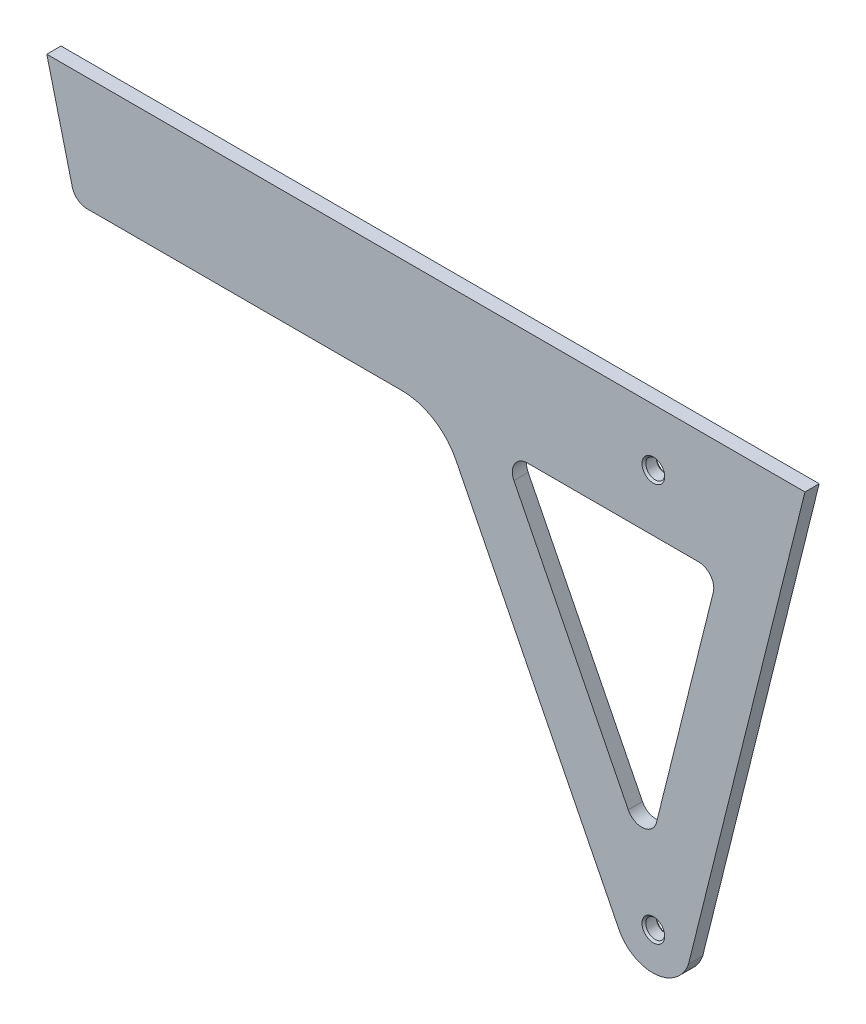
ISO-10303-21;
HEADER;
FILE_DESCRIPTION(('STEP AP214'),'2;1');
FILE_NAME('part.step','',(''),(''),'','','');
FILE_SCHEMA(('AUTOMOTIVE_DESIGN { 1 0 10303 214 1 1 1 1 }'));
ENDSEC;
DATA;
#1=APPLICATION_CONTEXT('core data for automotive mechanical design processes');
#2=APPLICATION_PROTOCOL_DEFINITION('international standard','automotive_design',2000,#1);
#3=PRODUCT_CONTEXT('',#1,'mechanical');
#4=PRODUCT('Part','Part','',(#3));
#5=PRODUCT_RELATED_PRODUCT_CATEGORY('part','',(#4));
#6=PRODUCT_DEFINITION_FORMATION('','',#4);
#7=PRODUCT_DEFINITION_CONTEXT('part definition',#1,'design');
#8=PRODUCT_DEFINITION('design','',#6,#7);
#9=PRODUCT_DEFINITION_SHAPE('','',#8);
#10=(LENGTH_UNIT() NAMED_UNIT(*) SI_UNIT(.MILLI.,.METRE.));
#11=(NAMED_UNIT(*) PLANE_ANGLE_UNIT() SI_UNIT($,.RADIAN.));
#12=(NAMED_UNIT(*) SI_UNIT($,.STERADIAN.) SOLID_ANGLE_UNIT());
#13=UNCERTAINTY_MEASURE_WITH_UNIT(LENGTH_MEASURE(1.E-05),#10,'distance_accuracy_value','');
#14=(GEOMETRIC_REPRESENTATION_CONTEXT(3) GLOBAL_UNCERTAINTY_ASSIGNED_CONTEXT((#13)) GLOBAL_UNIT_ASSIGNED_CONTEXT((#10,
#11,#12)) REPRESENTATION_CONTEXT('',''));
#15=CARTESIAN_POINT('',(0.,0.,0.));
#16=DIRECTION('',(0.,0.,1.));
#17=DIRECTION('',(1.,0.,0.));
#18=AXIS2_PLACEMENT_3D('',#15,#16,#17);
#19=CARTESIAN_POINT('',(118.956511571512,-58.4199804180646,4.7625));
#20=DIRECTION('',(0.,0.,1.));
#21=DIRECTION('',(1.,0.,0.));
#22=AXIS2_PLACEMENT_3D('',#19,#20,#21);
#23=PLANE('',#22);
#24=CARTESIAN_POINT('',(203.2,-19.05,4.7625));
#25=DIRECTION('',(0.,0.,1.));
#26=DIRECTION('',(1.,0.,0.));
#27=AXIS2_PLACEMENT_3D('',#24,#25,#26);
#28=CIRCLE('',#27,3.81000000000012);
#29=CARTESIAN_POINT('',(207.01,-19.05,4.7625));
#30=VERTEX_POINT('',#29);
#31=EDGE_CURVE('E257',#30,#30,#28,.F.);
#32=ORIENTED_EDGE('',*,*,#31,.T.);
#33=EDGE_LOOP('',(#32));
#34=FACE_BOUND('',#33,.T.);
#35=CARTESIAN_POINT('',(203.2,-152.4,4.7625));
#36=DIRECTION('',(0.,0.,1.));
#37=DIRECTION('',(1.,0.,0.));
#38=AXIS2_PLACEMENT_3D('',#35,#36,#37);
#39=CIRCLE('',#38,3.81000000000012);
#40=CARTESIAN_POINT('',(207.01,-152.4,4.7625));
#41=VERTEX_POINT('',#40);
#42=EDGE_CURVE('E251',#41,#41,#39,.F.);
#43=ORIENTED_EDGE('',*,*,#42,.T.);
#44=EDGE_LOOP('',(#43));
#45=FACE_BOUND('',#44,.T.);
#46=CARTESIAN_POINT('',(118.956511571512,-58.4199804180646,4.7625));
#47=DIRECTION('',(0.,0.,1.));
#48=DIRECTION('',(1.,0.,0.));
#49=AXIS2_PLACEMENT_3D('',#46,#47,#48);
#50=CIRCLE('',#49,20.32);
#51=CARTESIAN_POINT('',(137.120577334866,-49.3112420342629,4.7625));
#52=VERTEX_POINT('',#51);
#53=CARTESIAN_POINT('',(118.984721666729,-38.1,4.7625));
#54=VERTEX_POINT('',#53);
#55=EDGE_CURVE('E190',#52,#54,#50,.T.);
#56=ORIENTED_EDGE('',*,*,#55,.F.);
#57=DIRECTION('',(0.448264684242211,-0.893900874180818,0.));
#58=VECTOR('',#57,1.);
#59=CARTESIAN_POINT('',(137.120577334866,-49.3112420342629,4.7625));
#60=LINE('',#59,#58);
#61=CARTESIAN_POINT('',(191.635932138626,-158.022289387322,4.7625));
#62=VERTEX_POINT('',#61);
#63=EDGE_CURVE('E208',#52,#62,#60,.T.);
#64=ORIENTED_EDGE('',*,*,#63,.T.);
#65=CARTESIAN_POINT('',(202.988473240723,-152.329327897446,4.7625));
#66=DIRECTION('',(0.,0.,1.));
#67=DIRECTION('',(1.,0.,0.));
#68=AXIS2_PLACEMENT_3D('',#65,#66,#67);
#69=CIRCLE('',#68,12.7);
#70=CARTESIAN_POINT('',(214.970337379944,-156.539426678856,4.7625));
#71=VERTEX_POINT('',#70);
#72=EDGE_CURVE('E206',#62,#71,#69,.T.);
#73=ORIENTED_EDGE('',*,*,#72,.T.);
#74=DIRECTION('',(-0.241921895599668,-0.970295726275996,0.));
#75=VECTOR('',#74,1.);
#76=CARTESIAN_POINT('',(254.,0.,4.7625));
#77=LINE('',#76,#75);
#78=CARTESIAN_POINT('',(254.,0.,4.7625));
#79=VERTEX_POINT('',#78);
#80=EDGE_CURVE('E203',#79,#71,#77,.T.);
#81=ORIENTED_EDGE('',*,*,#80,.F.);
#82=DIRECTION('',(1.,0.,0.));
#83=VECTOR('',#82,1.);
#84=CARTESIAN_POINT('',(0.,0.,4.7625));
#85=LINE('',#84,#83);
#86=CARTESIAN_POINT('',(0.,0.,4.7625));
#87=VERTEX_POINT('',#86);
#88=EDGE_CURVE('E200',#87,#79,#85,.T.);
#89=ORIENTED_EDGE('',*,*,#88,.F.);
#90=DIRECTION('',(0.241921895599669,-0.970295726275996,0.));
#91=VECTOR('',#90,1.);
#92=CARTESIAN_POINT('',(0.,0.,4.7625));
#93=LINE('',#92,#91);
#94=CARTESIAN_POINT('',(8.53922560149728,-34.2489632296463,4.7625));
#95=VERTEX_POINT('',#94);
#96=EDGE_CURVE('E198',#87,#95,#93,.T.);
#97=ORIENTED_EDGE('',*,*,#96,.T.);
#98=CARTESIAN_POINT('',(13.4683278909793,-33.02,4.7625));
#99=DIRECTION('',(0.,0.,1.));
#100=DIRECTION('',(1.,0.,0.));
#101=AXIS2_PLACEMENT_3D('',#98,#99,#100);
#102=CIRCLE('',#101,5.08);
#103=CARTESIAN_POINT('',(13.4683278909794,-38.1,4.7625));
#104=VERTEX_POINT('',#103);
#105=EDGE_CURVE('E196',#95,#104,#102,.T.);
#106=ORIENTED_EDGE('',*,*,#105,.T.);
#107=DIRECTION('',(1.,0.,0.));
#108=VECTOR('',#107,1.);
#109=CARTESIAN_POINT('',(13.4683278909794,-38.1,4.7625));
#110=LINE('',#109,#108);
#111=EDGE_CURVE('E193',#104,#54,#110,.T.);
#112=ORIENTED_EDGE('',*,*,#111,.T.);
#113=EDGE_LOOP('',(#56,#64,#73,#81,#89,#97,#106,#112));
#114=FACE_BOUND('',#113,.T.);
#115=DIRECTION('',(-0.241921895599668,-0.970295726275996,0.));
#116=VECTOR('',#115,1.);
#117=CARTESIAN_POINT('',(223.2944122505,-44.4089632296464,4.7625));
#118=LINE('',#117,#116);
#119=CARTESIAN_POINT('',(223.2944122505,-44.4089632296464,4.7625));
#120=VERTEX_POINT('',#119);
#121=CARTESIAN_POINT('',(204.257595644947,-120.761464306418,4.7625));
#122=VERTEX_POINT('',#121);
#123=EDGE_CURVE('E146',#120,#122,#118,.T.);
#124=ORIENTED_EDGE('',*,*,#123,.T.);
#125=CARTESIAN_POINT('',(199.328493355465,-119.532501076772,4.7625));
#126=DIRECTION('',(0.,0.,-1.));
#127=DIRECTION('',(-1.,0.,0.));
#128=AXIS2_PLACEMENT_3D('',#125,#126,#127);
#129=CIRCLE('',#128,5.08);
#130=CARTESIAN_POINT('',(194.787476914626,-121.809685672722,4.7625));
#131=VERTEX_POINT('',#130);
#132=EDGE_CURVE('E50',#122,#131,#129,.T.);
#133=ORIENTED_EDGE('',*,*,#132,.T.);
#134=DIRECTION('',(-0.44826468424221,0.893900874180818,0.));
#135=VECTOR('',#134,1.);
#136=CARTESIAN_POINT('',(194.787476914626,-121.809685672722,4.7625));
#137=LINE('',#136,#135);
#138=CARTESIAN_POINT('',(156.498970017654,-45.4571845959505,4.7625));
#139=VERTEX_POINT('',#138);
#140=EDGE_CURVE('E152',#131,#139,#137,.T.);
#141=ORIENTED_EDGE('',*,*,#140,.T.);
#142=CARTESIAN_POINT('',(161.039986458493,-43.18,4.7625));
#143=DIRECTION('',(0.,0.,1.));
#144=DIRECTION('',(1.,0.,0.));
#145=AXIS2_PLACEMENT_3D('',#142,#143,#144);
#146=CIRCLE('',#145,5.08);
#147=CARTESIAN_POINT('',(161.039986458493,-38.1,4.7625));
#148=VERTEX_POINT('',#147);
#149=EDGE_CURVE('E171',#148,#139,#146,.T.);
#150=ORIENTED_EDGE('',*,*,#149,.F.);
#151=DIRECTION('',(1.,0.,0.));
#152=VECTOR('',#151,1.);
#153=CARTESIAN_POINT('',(161.039986458493,-38.1,4.7625));
#154=LINE('',#153,#152);
#155=CARTESIAN_POINT('',(218.365309961018,-38.1,4.7625));
#156=VERTEX_POINT('',#155);
#157=EDGE_CURVE('E174',#148,#156,#154,.T.);
#158=ORIENTED_EDGE('',*,*,#157,.T.);
#159=CARTESIAN_POINT('',(218.365309961018,-43.18,4.7625));
#160=DIRECTION('',(0.,0.,1.));
#161=DIRECTION('',(1.,0.,0.));
#162=AXIS2_PLACEMENT_3D('',#159,#160,#161);
#163=CIRCLE('',#162,5.08);
#164=EDGE_CURVE('E177',#120,#156,#163,.T.);
#165=ORIENTED_EDGE('',*,*,#164,.F.);
#166=EDGE_LOOP('',(#124,#133,#141,#150,#158,#165));
#167=FACE_BOUND('',#166,.T.);
#168=ADVANCED_FACE('F34',(#34,#45,#114,#167),#23,.T.);
#169=CARTESIAN_POINT('',(118.956511571512,-58.4199804180646,0.));
#170=DIRECTION('',(0.,0.,1.));
#171=DIRECTION('',(1.,0.,0.));
#172=AXIS2_PLACEMENT_3D('',#169,#170,#171);
#173=PLANE('',#172);
#174=CARTESIAN_POINT('',(203.2,-152.4,0.));
#175=DIRECTION('',(0.,0.,1.));
#176=DIRECTION('',(1.,0.,0.));
#177=AXIS2_PLACEMENT_3D('',#174,#175,#176);
#178=CIRCLE('',#177,3.80999999999976);
#179=CARTESIAN_POINT('',(207.01,-152.4,0.));
#180=VERTEX_POINT('',#179);
#181=EDGE_CURVE('E43',#180,#180,#178,.T.);
#182=ORIENTED_EDGE('',*,*,#181,.T.);
#183=EDGE_LOOP('',(#182));
#184=FACE_BOUND('',#183,.T.);
#185=CARTESIAN_POINT('',(203.2,-19.05,0.));
#186=DIRECTION('',(0.,0.,1.));
#187=DIRECTION('',(1.,0.,0.));
#188=AXIS2_PLACEMENT_3D('',#185,#186,#187);
#189=CIRCLE('',#188,3.80999999999984);
#190=CARTESIAN_POINT('',(207.01,-19.05,0.));
#191=VERTEX_POINT('',#190);
#192=EDGE_CURVE('E260',#191,#191,#189,.T.);
#193=ORIENTED_EDGE('',*,*,#192,.T.);
#194=EDGE_LOOP('',(#193));
#195=FACE_BOUND('',#194,.T.);
#196=CARTESIAN_POINT('',(118.956511571512,-58.4199804180646,0.));
#197=DIRECTION('',(0.,0.,1.));
#198=DIRECTION('',(1.,0.,0.));
#199=AXIS2_PLACEMENT_3D('',#196,#197,#198);
#200=CIRCLE('',#199,20.32);
#201=CARTESIAN_POINT('',(137.120577334866,-49.3112420342629,0.));
#202=VERTEX_POINT('',#201);
#203=CARTESIAN_POINT('',(118.984721666729,-38.1,0.));
#204=VERTEX_POINT('',#203);
#205=EDGE_CURVE('E153',#202,#204,#200,.T.);
#206=ORIENTED_EDGE('',*,*,#205,.T.);
#207=DIRECTION('',(1.,0.,0.));
#208=VECTOR('',#207,1.);
#209=CARTESIAN_POINT('',(13.4683278909794,-38.1,0.));
#210=LINE('',#209,#208);
#211=CARTESIAN_POINT('',(13.4683278909794,-38.1,0.));
#212=VERTEX_POINT('',#211);
#213=EDGE_CURVE('E213',#212,#204,#210,.T.);
#214=ORIENTED_EDGE('',*,*,#213,.F.);
#215=CARTESIAN_POINT('',(13.4683278909793,-33.02,0.));
#216=DIRECTION('',(0.,0.,1.));
#217=DIRECTION('',(1.,0.,0.));
#218=AXIS2_PLACEMENT_3D('',#215,#216,#217);
#219=CIRCLE('',#218,5.08);
#220=CARTESIAN_POINT('',(8.53922560149728,-34.2489632296463,0.));
#221=VERTEX_POINT('',#220);
#222=EDGE_CURVE('E216',#221,#212,#219,.T.);
#223=ORIENTED_EDGE('',*,*,#222,.F.);
#224=DIRECTION('',(0.241921895599669,-0.970295726275996,0.));
#225=VECTOR('',#224,1.);
#226=CARTESIAN_POINT('',(0.,0.,0.));
#227=LINE('',#226,#225);
#228=CARTESIAN_POINT('',(0.,0.,0.));
#229=VERTEX_POINT('',#228);
#230=EDGE_CURVE('E218',#229,#221,#227,.T.);
#231=ORIENTED_EDGE('',*,*,#230,.F.);
#232=DIRECTION('',(1.,0.,0.));
#233=VECTOR('',#232,1.);
#234=CARTESIAN_POINT('',(0.,0.,0.));
#235=LINE('',#234,#233);
#236=CARTESIAN_POINT('',(254.,0.,0.));
#237=VERTEX_POINT('',#236);
#238=EDGE_CURVE('E220',#229,#237,#235,.T.);
#239=ORIENTED_EDGE('',*,*,#238,.T.);
#240=DIRECTION('',(-0.241921895599668,-0.970295726275996,0.));
#241=VECTOR('',#240,1.);
#242=CARTESIAN_POINT('',(254.,0.,0.));
#243=LINE('',#242,#241);
#244=CARTESIAN_POINT('',(214.970337379944,-156.539426678856,0.));
#245=VERTEX_POINT('',#244);
#246=EDGE_CURVE('E223',#237,#245,#243,.T.);
#247=ORIENTED_EDGE('',*,*,#246,.T.);
#248=CARTESIAN_POINT('',(202.988473240723,-152.329327897446,0.));
#249=DIRECTION('',(0.,0.,1.));
#250=DIRECTION('',(1.,0.,0.));
#251=AXIS2_PLACEMENT_3D('',#248,#249,#250);
#252=CIRCLE('',#251,12.7);
#253=CARTESIAN_POINT('',(191.635932138626,-158.022289387322,0.));
#254=VERTEX_POINT('',#253);
#255=EDGE_CURVE('E226',#254,#245,#252,.T.);
#256=ORIENTED_EDGE('',*,*,#255,.F.);
#257=DIRECTION('',(0.448264684242211,-0.893900874180818,0.));
#258=VECTOR('',#257,1.);
#259=CARTESIAN_POINT('',(137.120577334866,-49.3112420342629,0.));
#260=LINE('',#259,#258);
#261=EDGE_CURVE('E194',#202,#254,#260,.T.);
#262=ORIENTED_EDGE('',*,*,#261,.F.);
#263=EDGE_LOOP('',(#206,#214,#223,#231,#239,#247,#256,#262));
#264=FACE_BOUND('',#263,.T.);
#265=CARTESIAN_POINT('',(199.328493355465,-119.532501076772,0.));
#266=DIRECTION('',(0.,0.,-1.));
#267=DIRECTION('',(-1.,0.,0.));
#268=AXIS2_PLACEMENT_3D('',#265,#266,#267);
#269=CIRCLE('',#268,5.08);
#270=CARTESIAN_POINT('',(204.257595644947,-120.761464306418,0.));
#271=VERTEX_POINT('',#270);
#272=CARTESIAN_POINT('',(194.787476914626,-121.809685672722,0.));
#273=VERTEX_POINT('',#272);
#274=EDGE_CURVE('E137',#271,#273,#269,.T.);
#275=ORIENTED_EDGE('',*,*,#274,.F.);
#276=DIRECTION('',(-0.241921895599668,-0.970295726275996,0.));
#277=VECTOR('',#276,1.);
#278=CARTESIAN_POINT('',(223.2944122505,-44.4089632296464,0.));
#279=LINE('',#278,#277);
#280=CARTESIAN_POINT('',(223.2944122505,-44.4089632296464,0.));
#281=VERTEX_POINT('',#280);
#282=EDGE_CURVE('E167',#281,#271,#279,.T.);
#283=ORIENTED_EDGE('',*,*,#282,.F.);
#284=CARTESIAN_POINT('',(218.365309961018,-43.18,0.));
#285=DIRECTION('',(0.,0.,1.));
#286=DIRECTION('',(1.,0.,0.));
#287=AXIS2_PLACEMENT_3D('',#284,#285,#286);
#288=CIRCLE('',#287,5.08);
#289=CARTESIAN_POINT('',(218.365309961018,-38.1,0.));
#290=VERTEX_POINT('',#289);
#291=EDGE_CURVE('E58',#281,#290,#288,.T.);
#292=ORIENTED_EDGE('',*,*,#291,.T.);
#293=DIRECTION('',(1.,0.,0.));
#294=VECTOR('',#293,1.);
#295=CARTESIAN_POINT('',(161.039986458493,-38.1,0.));
#296=LINE('',#295,#294);
#297=CARTESIAN_POINT('',(161.039986458493,-38.1,0.));
#298=VERTEX_POINT('',#297);
#299=EDGE_CURVE('E162',#298,#290,#296,.T.);
#300=ORIENTED_EDGE('',*,*,#299,.F.);
#301=CARTESIAN_POINT('',(161.039986458493,-43.18,0.));
#302=DIRECTION('',(0.,0.,1.));
#303=DIRECTION('',(1.,0.,0.));
#304=AXIS2_PLACEMENT_3D('',#301,#302,#303);
#305=CIRCLE('',#304,5.08);
#306=CARTESIAN_POINT('',(156.498970017654,-45.4571845959505,0.));
#307=VERTEX_POINT('',#306);
#308=EDGE_CURVE('E160',#298,#307,#305,.T.);
#309=ORIENTED_EDGE('',*,*,#308,.T.);
#310=DIRECTION('',(-0.44826468424221,0.893900874180818,0.));
#311=VECTOR('',#310,1.);
#312=CARTESIAN_POINT('',(194.787476914626,-121.809685672722,0.));
#313=LINE('',#312,#311);
#314=EDGE_CURVE('E145',#273,#307,#313,.T.);
#315=ORIENTED_EDGE('',*,*,#314,.F.);
#316=EDGE_LOOP('',(#275,#283,#292,#300,#309,#315));
#317=FACE_BOUND('',#316,.T.);
#318=ADVANCED_FACE('F157',(#184,#195,#264,#317),#173,.F.);
#319=CARTESIAN_POINT('',(118.956511571512,-58.4199804180646,4.7625));
#320=DIRECTION('',(0.,0.,-1.));
#321=DIRECTION('',(-1.,0.,0.));
#322=AXIS2_PLACEMENT_3D('',#319,#320,#321);
#323=CYLINDRICAL_SURFACE('',#322,20.32);
#324=ORIENTED_EDGE('',*,*,#205,.F.);
#325=DIRECTION('',(0.,0.,-1.));
#326=VECTOR('',#325,1.);
#327=CARTESIAN_POINT('',(137.120577334866,-49.3112420342629,4.7625));
#328=LINE('',#327,#326);
#329=EDGE_CURVE('E230',#52,#202,#328,.T.);
#330=ORIENTED_EDGE('',*,*,#329,.F.);
#331=ORIENTED_EDGE('',*,*,#55,.T.);
#332=DIRECTION('',(0.,0.,-1.));
#333=VECTOR('',#332,1.);
#334=CARTESIAN_POINT('',(118.984721666729,-38.1,4.7625));
#335=LINE('',#334,#333);
#336=EDGE_CURVE('E210',#54,#204,#335,.T.);
#337=ORIENTED_EDGE('',*,*,#336,.T.);
#338=EDGE_LOOP('',(#324,#330,#331,#337));
#339=FACE_BOUND('',#338,.T.);
#340=ADVANCED_FACE('F285',(#339),#323,.F.);
#341=CARTESIAN_POINT('',(137.120577334866,-49.3112420342629,4.7625));
#342=DIRECTION('',(0.893900874180818,0.448264684242211,0.));
#343=DIRECTION('',(-0.448264684242211,0.893900874180818,0.));
#344=AXIS2_PLACEMENT_3D('',#341,#342,#343);
#345=PLANE('',#344);
#346=ORIENTED_EDGE('',*,*,#261,.T.);
#347=DIRECTION('',(0.,0.,-1.));
#348=VECTOR('',#347,1.);
#349=CARTESIAN_POINT('',(191.635932138626,-158.022289387322,4.7625));
#350=LINE('',#349,#348);
#351=EDGE_CURVE('E233',#62,#254,#350,.T.);
#352=ORIENTED_EDGE('',*,*,#351,.F.);
#353=ORIENTED_EDGE('',*,*,#63,.F.);
#354=ORIENTED_EDGE('',*,*,#329,.T.);
#355=EDGE_LOOP('',(#346,#352,#353,#354));
#356=FACE_BOUND('',#355,.T.);
#357=ADVANCED_FACE('F292',(#356),#345,.F.);
#358=CARTESIAN_POINT('',(202.988473240723,-152.329327897446,4.7625));
#359=DIRECTION('',(0.,0.,-1.));
#360=DIRECTION('',(-1.,0.,0.));
#361=AXIS2_PLACEMENT_3D('',#358,#359,#360);
#362=CYLINDRICAL_SURFACE('',#361,12.7);
#363=ORIENTED_EDGE('',*,*,#255,.T.);
#364=DIRECTION('',(0.,0.,-1.));
#365=VECTOR('',#364,1.);
#366=CARTESIAN_POINT('',(214.970337379944,-156.539426678856,4.7625));
#367=LINE('',#366,#365);
#368=EDGE_CURVE('E236',#71,#245,#367,.T.);
#369=ORIENTED_EDGE('',*,*,#368,.F.);
#370=ORIENTED_EDGE('',*,*,#72,.F.);
#371=ORIENTED_EDGE('',*,*,#351,.T.);
#372=EDGE_LOOP('',(#363,#369,#370,#371));
#373=FACE_BOUND('',#372,.T.);
#374=ADVANCED_FACE('F295',(#373),#362,.T.);
#375=CARTESIAN_POINT('',(254.,0.,4.7625));
#376=DIRECTION('',(0.970295726275996,-0.241921895599668,0.));
#377=DIRECTION('',(0.241921895599668,0.970295726275996,0.));
#378=AXIS2_PLACEMENT_3D('',#375,#376,#377);
#379=PLANE('',#378);
#380=ORIENTED_EDGE('',*,*,#246,.F.);
#381=DIRECTION('',(0.,0.,-1.));
#382=VECTOR('',#381,1.);
#383=CARTESIAN_POINT('',(254.,0.,4.7625));
#384=LINE('',#383,#382);
#385=EDGE_CURVE('E238',#79,#237,#384,.T.);
#386=ORIENTED_EDGE('',*,*,#385,.F.);
#387=ORIENTED_EDGE('',*,*,#80,.T.);
#388=ORIENTED_EDGE('',*,*,#368,.T.);
#389=EDGE_LOOP('',(#380,#386,#387,#388));
#390=FACE_BOUND('',#389,.T.);
#391=ADVANCED_FACE('F299',(#390),#379,.T.);
#392=CARTESIAN_POINT('',(0.,0.,4.7625));
#393=DIRECTION('',(0.,1.,0.));
#394=DIRECTION('',(0.,0.,1.));
#395=AXIS2_PLACEMENT_3D('',#392,#393,#394);
#396=PLANE('',#395);
#397=ORIENTED_EDGE('',*,*,#238,.F.);
#398=DIRECTION('',(0.,0.,-1.));
#399=VECTOR('',#398,1.);
#400=CARTESIAN_POINT('',(0.,0.,4.7625));
#401=LINE('',#400,#399);
#402=EDGE_CURVE('E240',#87,#229,#401,.T.);
#403=ORIENTED_EDGE('',*,*,#402,.F.);
#404=ORIENTED_EDGE('',*,*,#88,.T.);
#405=ORIENTED_EDGE('',*,*,#385,.T.);
#406=EDGE_LOOP('',(#397,#403,#404,#405));
#407=FACE_BOUND('',#406,.T.);
#408=ADVANCED_FACE('F303',(#407),#396,.T.);
#409=CARTESIAN_POINT('',(0.,0.,4.7625));
#410=DIRECTION('',(0.970295726275996,0.241921895599669,0.));
#411=DIRECTION('',(-0.241921895599669,0.970295726275996,0.));
#412=AXIS2_PLACEMENT_3D('',#409,#410,#411);
#413=PLANE('',#412);
#414=ORIENTED_EDGE('',*,*,#230,.T.);
#415=DIRECTION('',(0.,0.,-1.));
#416=VECTOR('',#415,1.);
#417=CARTESIAN_POINT('',(8.53922560149728,-34.2489632296463,4.7625));
#418=LINE('',#417,#416);
#419=EDGE_CURVE('E242',#95,#221,#418,.T.);
#420=ORIENTED_EDGE('',*,*,#419,.F.);
#421=ORIENTED_EDGE('',*,*,#96,.F.);
#422=ORIENTED_EDGE('',*,*,#402,.T.);
#423=EDGE_LOOP('',(#414,#420,#421,#422));
#424=FACE_BOUND('',#423,.T.);
#425=ADVANCED_FACE('F307',(#424),#413,.F.);
#426=CARTESIAN_POINT('',(13.4683278909793,-33.02,4.7625));
#427=DIRECTION('',(0.,0.,-1.));
#428=DIRECTION('',(-1.,0.,0.));
#429=AXIS2_PLACEMENT_3D('',#426,#427,#428);
#430=CYLINDRICAL_SURFACE('',#429,5.08);
#431=ORIENTED_EDGE('',*,*,#222,.T.);
#432=DIRECTION('',(0.,0.,-1.));
#433=VECTOR('',#432,1.);
#434=CARTESIAN_POINT('',(13.4683278909794,-38.1,4.7625));
#435=LINE('',#434,#433);
#436=EDGE_CURVE('E245',#104,#212,#435,.T.);
#437=ORIENTED_EDGE('',*,*,#436,.F.);
#438=ORIENTED_EDGE('',*,*,#105,.F.);
#439=ORIENTED_EDGE('',*,*,#419,.T.);
#440=EDGE_LOOP('',(#431,#437,#438,#439));
#441=FACE_BOUND('',#440,.T.);
#442=ADVANCED_FACE('F311',(#441),#430,.T.);
#443=CARTESIAN_POINT('',(13.4683278909794,-38.1,4.7625));
#444=DIRECTION('',(0.,1.,0.));
#445=DIRECTION('',(0.,0.,1.));
#446=AXIS2_PLACEMENT_3D('',#443,#444,#445);
#447=PLANE('',#446);
#448=ORIENTED_EDGE('',*,*,#213,.T.);
#449=ORIENTED_EDGE('',*,*,#336,.F.);
#450=ORIENTED_EDGE('',*,*,#111,.F.);
#451=ORIENTED_EDGE('',*,*,#436,.T.);
#452=EDGE_LOOP('',(#448,#449,#450,#451));
#453=FACE_BOUND('',#452,.T.);
#454=ADVANCED_FACE('F315',(#453),#447,.F.);
#455=CARTESIAN_POINT('',(203.2,-19.05,0.));
#456=DIRECTION('',(0.,0.,1.));
#457=DIRECTION('',(1.,0.,0.));
#458=AXIS2_PLACEMENT_3D('',#455,#456,#457);
#459=CYLINDRICAL_SURFACE('',#458,3.175);
#460=CARTESIAN_POINT('',(203.2,-19.05,0.634999999999836));
#461=DIRECTION('',(0.,0.,1.));
#462=DIRECTION('',(1.,0.,0.));
#463=AXIS2_PLACEMENT_3D('',#460,#461,#462);
#464=CIRCLE('',#463,3.175);
#465=CARTESIAN_POINT('',(206.375,-19.05,0.634999999999836));
#466=VERTEX_POINT('',#465);
#467=EDGE_CURVE('E263',#466,#466,#464,.F.);
#468=ORIENTED_EDGE('',*,*,#467,.T.);
#469=EDGE_LOOP('',(#468));
#470=FACE_BOUND('',#469,.T.);
#471=CARTESIAN_POINT('',(203.2,-19.05,4.12749999999988));
#472=DIRECTION('',(0.,0.,1.));
#473=DIRECTION('',(1.,0.,0.));
#474=AXIS2_PLACEMENT_3D('',#471,#472,#473);
#475=CIRCLE('',#474,3.175);
#476=CARTESIAN_POINT('',(206.375,-19.05,4.12749999999988));
#477=VERTEX_POINT('',#476);
#478=EDGE_CURVE('E254',#477,#477,#475,.T.);
#479=ORIENTED_EDGE('',*,*,#478,.T.);
#480=EDGE_LOOP('',(#479));
#481=FACE_BOUND('',#480,.T.);
#482=ADVANCED_FACE('F289',(#470,#481),#459,.F.);
#483=CARTESIAN_POINT('',(203.2,-152.4,0.));
#484=DIRECTION('',(0.,0.,1.));
#485=DIRECTION('',(1.,0.,0.));
#486=AXIS2_PLACEMENT_3D('',#483,#484,#485);
#487=CYLINDRICAL_SURFACE('',#486,3.175);
#488=CARTESIAN_POINT('',(203.2,-152.4,0.634999999999755));
#489=DIRECTION('',(0.,0.,1.));
#490=DIRECTION('',(1.,0.,0.));
#491=AXIS2_PLACEMENT_3D('',#488,#489,#490);
#492=CIRCLE('',#491,3.175);
#493=CARTESIAN_POINT('',(206.375,-152.4,0.634999999999755));
#494=VERTEX_POINT('',#493);
#495=EDGE_CURVE('E11',#494,#494,#492,.F.);
#496=ORIENTED_EDGE('',*,*,#495,.T.);
#497=EDGE_LOOP('',(#496));
#498=FACE_BOUND('',#497,.T.);
#499=CARTESIAN_POINT('',(203.2,-152.4,4.12749999999988));
#500=DIRECTION('',(0.,0.,1.));
#501=DIRECTION('',(1.,0.,0.));
#502=AXIS2_PLACEMENT_3D('',#499,#500,#501);
#503=CIRCLE('',#502,3.175);
#504=CARTESIAN_POINT('',(206.375,-152.4,4.12749999999988));
#505=VERTEX_POINT('',#504);
#506=EDGE_CURVE('E232',#505,#505,#503,.T.);
#507=ORIENTED_EDGE('',*,*,#506,.T.);
#508=EDGE_LOOP('',(#507));
#509=FACE_BOUND('',#508,.T.);
#510=ADVANCED_FACE('F348',(#498,#509),#487,.F.);
#511=CARTESIAN_POINT('',(199.328493355465,-119.532501076772,0.));
#512=DIRECTION('',(0.,0.,1.));
#513=DIRECTION('',(1.,0.,0.));
#514=AXIS2_PLACEMENT_3D('',#511,#512,#513);
#515=CYLINDRICAL_SURFACE('',#514,5.08);
#516=ORIENTED_EDGE('',*,*,#132,.F.);
#517=DIRECTION('',(0.,0.,1.));
#518=VECTOR('',#517,1.);
#519=CARTESIAN_POINT('',(204.257595644947,-120.761464306418,0.));
#520=LINE('',#519,#518);
#521=EDGE_CURVE('E141',#271,#122,#520,.T.);
#522=ORIENTED_EDGE('',*,*,#521,.F.);
#523=ORIENTED_EDGE('',*,*,#274,.T.);
#524=DIRECTION('',(0.,0.,1.));
#525=VECTOR('',#524,1.);
#526=CARTESIAN_POINT('',(194.787476914626,-121.809685672722,0.));
#527=LINE('',#526,#525);
#528=EDGE_CURVE('E140',#273,#131,#527,.T.);
#529=ORIENTED_EDGE('',*,*,#528,.T.);
#530=EDGE_LOOP('',(#516,#522,#523,#529));
#531=FACE_BOUND('',#530,.T.);
#532=ADVANCED_FACE('F139',(#531),#515,.F.);
#533=CARTESIAN_POINT('',(194.787476914626,-121.809685672722,0.));
#534=DIRECTION('',(0.893900874180818,0.44826468424221,0.));
#535=DIRECTION('',(-0.44826468424221,0.893900874180818,0.));
#536=AXIS2_PLACEMENT_3D('',#533,#534,#535);
#537=PLANE('',#536);
#538=ORIENTED_EDGE('',*,*,#140,.F.);
#539=ORIENTED_EDGE('',*,*,#528,.F.);
#540=ORIENTED_EDGE('',*,*,#314,.T.);
#541=DIRECTION('',(0.,0.,1.));
#542=VECTOR('',#541,1.);
#543=CARTESIAN_POINT('',(156.498970017654,-45.4571845959505,0.));
#544=LINE('',#543,#542);
#545=EDGE_CURVE('E154',#307,#139,#544,.T.);
#546=ORIENTED_EDGE('',*,*,#545,.T.);
#547=EDGE_LOOP('',(#538,#539,#540,#546));
#548=FACE_BOUND('',#547,.T.);
#549=ADVANCED_FACE('F149',(#548),#537,.T.);
#550=CARTESIAN_POINT('',(161.039986458493,-43.18,0.));
#551=DIRECTION('',(0.,0.,1.));
#552=DIRECTION('',(1.,0.,0.));
#553=AXIS2_PLACEMENT_3D('',#550,#551,#552);
#554=CYLINDRICAL_SURFACE('',#553,5.08);
#555=ORIENTED_EDGE('',*,*,#149,.T.);
#556=ORIENTED_EDGE('',*,*,#545,.F.);
#557=ORIENTED_EDGE('',*,*,#308,.F.);
#558=DIRECTION('',(0.,0.,1.));
#559=VECTOR('',#558,1.);
#560=CARTESIAN_POINT('',(161.039986458493,-38.1,0.));
#561=LINE('',#560,#559);
#562=EDGE_CURVE('E187',#298,#148,#561,.T.);
#563=ORIENTED_EDGE('',*,*,#562,.T.);
#564=EDGE_LOOP('',(#555,#556,#557,#563));
#565=FACE_BOUND('',#564,.T.);
#566=ADVANCED_FACE('F390',(#565),#554,.F.);
#567=CARTESIAN_POINT('',(161.039986458493,-38.1,0.));
#568=DIRECTION('',(0.,-1.,0.));
#569=DIRECTION('',(0.,0.,-1.));
#570=AXIS2_PLACEMENT_3D('',#567,#568,#569);
#571=PLANE('',#570);
#572=ORIENTED_EDGE('',*,*,#157,.F.);
#573=ORIENTED_EDGE('',*,*,#562,.F.);
#574=ORIENTED_EDGE('',*,*,#299,.T.);
#575=DIRECTION('',(0.,0.,1.));
#576=VECTOR('',#575,1.);
#577=CARTESIAN_POINT('',(218.365309961018,-38.1,0.));
#578=LINE('',#577,#576);
#579=EDGE_CURVE('E185',#290,#156,#578,.T.);
#580=ORIENTED_EDGE('',*,*,#579,.T.);
#581=EDGE_LOOP('',(#572,#573,#574,#580));
#582=FACE_BOUND('',#581,.T.);
#583=ADVANCED_FACE('F386',(#582),#571,.T.);
#584=CARTESIAN_POINT('',(218.365309961018,-43.18,0.));
#585=DIRECTION('',(0.,0.,1.));
#586=DIRECTION('',(1.,0.,0.));
#587=AXIS2_PLACEMENT_3D('',#584,#585,#586);
#588=CYLINDRICAL_SURFACE('',#587,5.08);
#589=ORIENTED_EDGE('',*,*,#164,.T.);
#590=ORIENTED_EDGE('',*,*,#579,.F.);
#591=ORIENTED_EDGE('',*,*,#291,.F.);
#592=DIRECTION('',(0.,0.,1.));
#593=VECTOR('',#592,1.);
#594=CARTESIAN_POINT('',(223.2944122505,-44.4089632296464,0.));
#595=LINE('',#594,#593);
#596=EDGE_CURVE('E183',#281,#120,#595,.T.);
#597=ORIENTED_EDGE('',*,*,#596,.T.);
#598=EDGE_LOOP('',(#589,#590,#591,#597));
#599=FACE_BOUND('',#598,.T.);
#600=ADVANCED_FACE('F387',(#599),#588,.F.);
#601=CARTESIAN_POINT('',(223.2944122505,-44.4089632296464,0.));
#602=DIRECTION('',(-0.970295726275996,0.241921895599668,0.));
#603=DIRECTION('',(-0.241921895599668,-0.970295726275996,0.));
#604=AXIS2_PLACEMENT_3D('',#601,#602,#603);
#605=PLANE('',#604);
#606=ORIENTED_EDGE('',*,*,#123,.F.);
#607=ORIENTED_EDGE('',*,*,#596,.F.);
#608=ORIENTED_EDGE('',*,*,#282,.T.);
#609=ORIENTED_EDGE('',*,*,#521,.T.);
#610=EDGE_LOOP('',(#606,#607,#608,#609));
#611=FACE_BOUND('',#610,.T.);
#612=ADVANCED_FACE('F330',(#611),#605,.T.);
#613=CARTESIAN_POINT('',(203.2,-152.4,4.12749999999988));
#614=DIRECTION('',(0.,0.,1.));
#615=DIRECTION('',(1.,0.,0.));
#616=AXIS2_PLACEMENT_3D('',#613,#614,#615);
#617=CONICAL_SURFACE('',#616,3.175,0.785398163397452);
#618=ORIENTED_EDGE('',*,*,#42,.F.);
#619=EDGE_LOOP('',(#618));
#620=FACE_BOUND('',#619,.T.);
#621=ORIENTED_EDGE('',*,*,#506,.F.);
#622=EDGE_LOOP('',(#621));
#623=FACE_BOUND('',#622,.T.);
#624=ADVANCED_FACE('F324',(#620,#623),#617,.F.);
#625=CARTESIAN_POINT('',(203.2,-19.05,4.12749999999989));
#626=DIRECTION('',(0.,0.,1.));
#627=DIRECTION('',(1.,0.,0.));
#628=AXIS2_PLACEMENT_3D('',#625,#626,#627);
#629=CONICAL_SURFACE('',#628,3.175,0.785398163397452);
#630=ORIENTED_EDGE('',*,*,#31,.F.);
#631=EDGE_LOOP('',(#630));
#632=FACE_BOUND('',#631,.T.);
#633=ORIENTED_EDGE('',*,*,#478,.F.);
#634=EDGE_LOOP('',(#633));
#635=FACE_BOUND('',#634,.T.);
#636=ADVANCED_FACE('F276',(#632,#635),#629,.F.);
#637=CARTESIAN_POINT('',(203.2,-19.05,0.));
#638=DIRECTION('',(0.,0.,-1.));
#639=DIRECTION('',(-1.,0.,0.));
#640=AXIS2_PLACEMENT_3D('',#637,#638,#639);
#641=CONICAL_SURFACE('',#640,3.80999999999984,0.785398163397453);
#642=ORIENTED_EDGE('',*,*,#467,.F.);
#643=EDGE_LOOP('',(#642));
#644=FACE_BOUND('',#643,.T.);
#645=ORIENTED_EDGE('',*,*,#192,.F.);
#646=EDGE_LOOP('',(#645));
#647=FACE_BOUND('',#646,.T.);
#648=ADVANCED_FACE('F271',(#644,#647),#641,.F.);
#649=CARTESIAN_POINT('',(203.2,-152.4,0.));
#650=DIRECTION('',(0.,0.,-1.));
#651=DIRECTION('',(-1.,0.,0.));
#652=AXIS2_PLACEMENT_3D('',#649,#650,#651);
#653=CONICAL_SURFACE('',#652,3.80999999999976,0.785398163397453);
#654=ORIENTED_EDGE('',*,*,#495,.F.);
#655=EDGE_LOOP('',(#654));
#656=FACE_BOUND('',#655,.T.);
#657=ORIENTED_EDGE('',*,*,#181,.F.);
#658=EDGE_LOOP('',(#657));
#659=FACE_BOUND('',#658,.T.);
#660=ADVANCED_FACE('F37',(#656,#659),#653,.F.);
#661=CLOSED_SHELL('',(#168,#318,#340,#357,#374,#391,#408,#425,#442,#454,#482,#510,#532,#549,
#566,#583,#600,#612,#624,#636,#648,#660));
#662=MANIFOLD_SOLID_BREP('B2',#661);
#663=ADVANCED_BREP_SHAPE_REPRESENTATION('',(#18,#662),#14);
#664=SHAPE_DEFINITION_REPRESENTATION(#9,#663);
ENDSEC;
END-ISO-10303-21;
